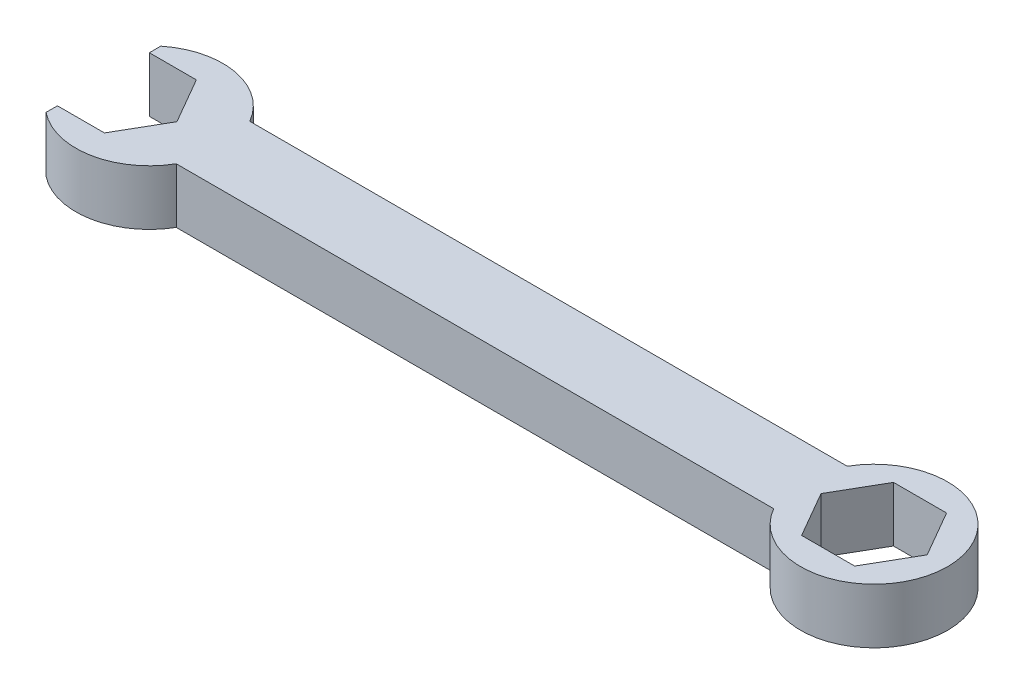
ISO-10303-21;
HEADER;
FILE_DESCRIPTION(('STEP AP214'),'2;1');
FILE_NAME('part.step','',(''),(''),'','','');
FILE_SCHEMA(('AUTOMOTIVE_DESIGN { 1 0 10303 214 1 1 1 1 }'));
ENDSEC;
DATA;
#1=APPLICATION_CONTEXT('core data for automotive mechanical design processes');
#2=APPLICATION_PROTOCOL_DEFINITION('international standard','automotive_design',2000,#1);
#3=PRODUCT_CONTEXT('',#1,'mechanical');
#4=PRODUCT('Part','Part','',(#3));
#5=PRODUCT_RELATED_PRODUCT_CATEGORY('part','',(#4));
#6=PRODUCT_DEFINITION_FORMATION('','',#4);
#7=PRODUCT_DEFINITION_CONTEXT('part definition',#1,'design');
#8=PRODUCT_DEFINITION('design','',#6,#7);
#9=PRODUCT_DEFINITION_SHAPE('','',#8);
#10=(LENGTH_UNIT() NAMED_UNIT(*) SI_UNIT(.MILLI.,.METRE.));
#11=(NAMED_UNIT(*) PLANE_ANGLE_UNIT() SI_UNIT($,.RADIAN.));
#12=(NAMED_UNIT(*) SI_UNIT($,.STERADIAN.) SOLID_ANGLE_UNIT());
#13=UNCERTAINTY_MEASURE_WITH_UNIT(LENGTH_MEASURE(1.E-05),#10,'distance_accuracy_value','');
#14=(GEOMETRIC_REPRESENTATION_CONTEXT(3) GLOBAL_UNCERTAINTY_ASSIGNED_CONTEXT((#13)) GLOBAL_UNIT_ASSIGNED_CONTEXT((#10,
#11,#12)) REPRESENTATION_CONTEXT('',''));
#15=CARTESIAN_POINT('',(0.,0.,0.));
#16=DIRECTION('',(0.,0.,1.));
#17=DIRECTION('',(1.,0.,0.));
#18=AXIS2_PLACEMENT_3D('',#15,#16,#17);
#19=CARTESIAN_POINT('',(0.,7.62,0.));
#20=DIRECTION('',(0.,-1.,0.));
#21=DIRECTION('',(0.,0.,-1.));
#22=AXIS2_PLACEMENT_3D('',#19,#20,#21);
#23=CYLINDRICAL_SURFACE('',#22,10.16);
#24=CARTESIAN_POINT('',(0.,0.,0.));
#25=DIRECTION('',(0.,1.,0.));
#26=DIRECTION('',(0.,0.,1.));
#27=AXIS2_PLACEMENT_3D('',#24,#25,#26);
#28=CIRCLE('',#27,10.16);
#29=CARTESIAN_POINT('',(-8.79881810244989,0.,5.08000000000002));
#30=VERTEX_POINT('',#29);
#31=CARTESIAN_POINT('',(-8.79881810244991,0.,-5.07999999999998));
#32=VERTEX_POINT('',#31);
#33=EDGE_CURVE('E280',#30,#32,#28,.T.);
#34=ORIENTED_EDGE('',*,*,#33,.T.);
#35=DIRECTION('',(0.,-1.,0.));
#36=VECTOR('',#35,1.);
#37=CARTESIAN_POINT('',(-8.79881810244991,7.62,-5.07999999999998));
#38=LINE('',#37,#36);
#39=CARTESIAN_POINT('',(-8.79881810244991,7.62,-5.07999999999998));
#40=VERTEX_POINT('',#39);
#41=EDGE_CURVE('E11',#40,#32,#38,.T.);
#42=ORIENTED_EDGE('',*,*,#41,.F.);
#43=CARTESIAN_POINT('',(0.,7.62,0.));
#44=DIRECTION('',(0.,1.,0.));
#45=DIRECTION('',(0.,0.,1.));
#46=AXIS2_PLACEMENT_3D('',#43,#44,#45);
#47=CIRCLE('',#46,10.16);
#48=CARTESIAN_POINT('',(-8.79881810244989,7.62,5.08000000000002));
#49=VERTEX_POINT('',#48);
#50=EDGE_CURVE('E200',#49,#40,#47,.T.);
#51=ORIENTED_EDGE('',*,*,#50,.F.);
#52=DIRECTION('',(0.,-1.,0.));
#53=VECTOR('',#52,1.);
#54=CARTESIAN_POINT('',(-8.79881810244989,7.62,5.08000000000002));
#55=LINE('',#54,#53);
#56=EDGE_CURVE('E228',#49,#30,#55,.T.);
#57=ORIENTED_EDGE('',*,*,#56,.T.);
#58=EDGE_LOOP('',(#34,#42,#51,#57));
#59=FACE_BOUND('',#58,.T.);
#60=ADVANCED_FACE('F41',(#59),#23,.T.);
#61=CARTESIAN_POINT('',(0.,7.62,-5.07999999999998));
#62=DIRECTION('',(0.,0.,-1.));
#63=DIRECTION('',(-1.,0.,0.));
#64=AXIS2_PLACEMENT_3D('',#61,#62,#63);
#65=PLANE('',#64);
#66=DIRECTION('',(1.,0.,0.));
#67=VECTOR('',#66,1.);
#68=CARTESIAN_POINT('',(0.,0.,-5.07999999999998));
#69=LINE('',#68,#67);
#70=CARTESIAN_POINT('',(-91.3488181024499,0.,-5.07999999999999));
#71=VERTEX_POINT('',#70);
#72=EDGE_CURVE('E283',#71,#32,#69,.T.);
#73=ORIENTED_EDGE('',*,*,#72,.F.);
#74=DIRECTION('',(0.,-1.,0.));
#75=VECTOR('',#74,1.);
#76=CARTESIAN_POINT('',(-91.3488181024499,7.62,-5.07999999999999));
#77=LINE('',#76,#75);
#78=CARTESIAN_POINT('',(-91.3488181024499,7.62,-5.07999999999999));
#79=VERTEX_POINT('',#78);
#80=EDGE_CURVE('E51',#79,#71,#77,.T.);
#81=ORIENTED_EDGE('',*,*,#80,.F.);
#82=DIRECTION('',(1.,0.,0.));
#83=VECTOR('',#82,1.);
#84=CARTESIAN_POINT('',(0.,7.62,-5.07999999999998));
#85=LINE('',#84,#83);
#86=EDGE_CURVE('E194',#79,#40,#85,.T.);
#87=ORIENTED_EDGE('',*,*,#86,.T.);
#88=ORIENTED_EDGE('',*,*,#41,.T.);
#89=EDGE_LOOP('',(#73,#81,#87,#88));
#90=FACE_BOUND('',#89,.T.);
#91=ADVANCED_FACE('F325',(#90),#65,.T.);
#92=CARTESIAN_POINT('',(-100.1476362049,7.62,0.));
#93=DIRECTION('',(0.,-1.,0.));
#94=DIRECTION('',(0.,0.,-1.));
#95=AXIS2_PLACEMENT_3D('',#92,#93,#94);
#96=CYLINDRICAL_SURFACE('',#95,10.16);
#97=CARTESIAN_POINT('',(-100.1476362049,0.,0.));
#98=DIRECTION('',(0.,1.,0.));
#99=DIRECTION('',(0.,0.,1.));
#100=AXIS2_PLACEMENT_3D('',#97,#98,#99);
#101=CIRCLE('',#100,10.16);
#102=CARTESIAN_POINT('',(-106.4976362049,0.,-7.93114745796597));
#103=VERTEX_POINT('',#102);
#104=EDGE_CURVE('E223',#71,#103,#101,.T.);
#105=ORIENTED_EDGE('',*,*,#104,.T.);
#106=DIRECTION('',(0.,-1.,0.));
#107=VECTOR('',#106,1.);
#108=CARTESIAN_POINT('',(-106.4976362049,7.62,-7.93114745796597));
#109=LINE('',#108,#107);
#110=CARTESIAN_POINT('',(-106.4976362049,7.62,-7.93114745796597));
#111=VERTEX_POINT('',#110);
#112=EDGE_CURVE('E240',#111,#103,#109,.T.);
#113=ORIENTED_EDGE('',*,*,#112,.F.);
#114=CARTESIAN_POINT('',(-100.1476362049,7.62,0.));
#115=DIRECTION('',(0.,1.,0.));
#116=DIRECTION('',(0.,0.,1.));
#117=AXIS2_PLACEMENT_3D('',#114,#115,#116);
#118=CIRCLE('',#117,10.16);
#119=EDGE_CURVE('E190',#79,#111,#118,.T.);
#120=ORIENTED_EDGE('',*,*,#119,.F.);
#121=ORIENTED_EDGE('',*,*,#80,.T.);
#122=EDGE_LOOP('',(#105,#113,#120,#121));
#123=FACE_BOUND('',#122,.T.);
#124=ADVANCED_FACE('F323',(#123),#96,.T.);
#125=CARTESIAN_POINT('',(-106.4976362049,7.62,0.));
#126=DIRECTION('',(1.,0.,0.));
#127=DIRECTION('',(0.,0.,-1.));
#128=AXIS2_PLACEMENT_3D('',#125,#126,#127);
#129=PLANE('',#128);
#130=DIRECTION('',(0.,0.,1.));
#131=VECTOR('',#130,1.);
#132=CARTESIAN_POINT('',(-106.4976362049,0.,0.));
#133=LINE('',#132,#131);
#134=CARTESIAN_POINT('',(-106.4976362049,0.,-6.34999999999995));
#135=VERTEX_POINT('',#134);
#136=EDGE_CURVE('E286',#103,#135,#133,.T.);
#137=ORIENTED_EDGE('',*,*,#136,.T.);
#138=DIRECTION('',(0.,-1.,0.));
#139=VECTOR('',#138,1.);
#140=CARTESIAN_POINT('',(-106.4976362049,7.62,-6.34999999999995));
#141=LINE('',#140,#139);
#142=CARTESIAN_POINT('',(-106.4976362049,7.62,-6.34999999999995));
#143=VERTEX_POINT('',#142);
#144=EDGE_CURVE('E238',#143,#135,#141,.T.);
#145=ORIENTED_EDGE('',*,*,#144,.F.);
#146=DIRECTION('',(0.,0.,1.));
#147=VECTOR('',#146,1.);
#148=CARTESIAN_POINT('',(-106.4976362049,7.62,0.));
#149=LINE('',#148,#147);
#150=EDGE_CURVE('E180',#111,#143,#149,.T.);
#151=ORIENTED_EDGE('',*,*,#150,.F.);
#152=ORIENTED_EDGE('',*,*,#112,.T.);
#153=EDGE_LOOP('',(#137,#145,#151,#152));
#154=FACE_BOUND('',#153,.T.);
#155=ADVANCED_FACE('F321',(#154),#129,.F.);
#156=CARTESIAN_POINT('',(0.,7.62,-6.34999999999995));
#157=DIRECTION('',(0.,0.,1.));
#158=DIRECTION('',(1.,0.,0.));
#159=AXIS2_PLACEMENT_3D('',#156,#157,#158);
#160=PLANE('',#159);
#161=DIRECTION('',(-1.,0.,0.));
#162=VECTOR('',#161,1.);
#163=CARTESIAN_POINT('',(0.,0.,-6.34999999999995));
#164=LINE('',#163,#162);
#165=CARTESIAN_POINT('',(-100.003810414254,0.,-6.34999999999995));
#166=VERTEX_POINT('',#165);
#167=EDGE_CURVE('E289',#166,#135,#164,.T.);
#168=ORIENTED_EDGE('',*,*,#167,.F.);
#169=DIRECTION('',(0.,-1.,0.));
#170=VECTOR('',#169,1.);
#171=CARTESIAN_POINT('',(-100.003810414254,7.62,-6.34999999999995));
#172=LINE('',#171,#170);
#173=CARTESIAN_POINT('',(-100.003810414254,7.62,-6.34999999999995));
#174=VERTEX_POINT('',#173);
#175=EDGE_CURVE('E236',#174,#166,#172,.T.);
#176=ORIENTED_EDGE('',*,*,#175,.F.);
#177=DIRECTION('',(-1.,0.,0.));
#178=VECTOR('',#177,1.);
#179=CARTESIAN_POINT('',(0.,7.62,-6.34999999999995));
#180=LINE('',#179,#178);
#181=EDGE_CURVE('E198',#174,#143,#180,.T.);
#182=ORIENTED_EDGE('',*,*,#181,.T.);
#183=ORIENTED_EDGE('',*,*,#144,.T.);
#184=EDGE_LOOP('',(#168,#176,#182,#183));
#185=FACE_BOUND('',#184,.T.);
#186=ADVANCED_FACE('F315',(#185),#160,.T.);
#187=CARTESIAN_POINT('',(-72.2532271536748,7.62,41.7154201469934));
#188=DIRECTION('',(-0.866025403784438,0.,0.500000000000001));
#189=DIRECTION('',(0.500000000000001,0.,0.866025403784438));
#190=AXIS2_PLACEMENT_3D('',#187,#188,#189);
#191=PLANE('',#190);
#192=DIRECTION('',(-0.500000000000001,0.,-0.866025403784438));
#193=VECTOR('',#192,1.);
#194=CARTESIAN_POINT('',(-72.2532271536748,0.,41.7154201469934));
#195=LINE('',#194,#193);
#196=CARTESIAN_POINT('',(-96.3376362048998,0.,0.));
#197=VERTEX_POINT('',#196);
#198=EDGE_CURVE('E292',#197,#166,#195,.T.);
#199=ORIENTED_EDGE('',*,*,#198,.F.);
#200=DIRECTION('',(0.,-1.,0.));
#201=VECTOR('',#200,1.);
#202=CARTESIAN_POINT('',(-96.3376362048998,7.62,0.));
#203=LINE('',#202,#201);
#204=CARTESIAN_POINT('',(-96.3376362048998,7.62,0.));
#205=VERTEX_POINT('',#204);
#206=EDGE_CURVE('E234',#205,#197,#203,.T.);
#207=ORIENTED_EDGE('',*,*,#206,.F.);
#208=DIRECTION('',(-0.500000000000001,0.,-0.866025403784438));
#209=VECTOR('',#208,1.);
#210=CARTESIAN_POINT('',(-72.2532271536748,7.62,41.7154201469934));
#211=LINE('',#210,#209);
#212=EDGE_CURVE('E541',#205,#174,#211,.T.);
#213=ORIENTED_EDGE('',*,*,#212,.T.);
#214=ORIENTED_EDGE('',*,*,#175,.T.);
#215=EDGE_LOOP('',(#199,#207,#213,#214));
#216=FACE_BOUND('',#215,.T.);
#217=ADVANCED_FACE('F310',(#216),#191,.T.);
#218=CARTESIAN_POINT('',(-72.2532271536749,7.62,-41.7154201469933));
#219=DIRECTION('',(-0.866025403784439,0.,-0.5));
#220=DIRECTION('',(-0.5,0.,0.866025403784439));
#221=AXIS2_PLACEMENT_3D('',#218,#219,#220);
#222=PLANE('',#221);
#223=DIRECTION('',(0.5,0.,-0.866025403784439));
#224=VECTOR('',#223,1.);
#225=CARTESIAN_POINT('',(-72.2532271536749,0.,-41.7154201469933));
#226=LINE('',#225,#224);
#227=CARTESIAN_POINT('',(-100.003810414254,0.,6.35000000000002));
#228=VERTEX_POINT('',#227);
#229=EDGE_CURVE('E294',#228,#197,#226,.T.);
#230=ORIENTED_EDGE('',*,*,#229,.F.);
#231=DIRECTION('',(0.,-1.,0.));
#232=VECTOR('',#231,1.);
#233=CARTESIAN_POINT('',(-100.003810414254,7.62,6.35000000000002));
#234=LINE('',#233,#232);
#235=CARTESIAN_POINT('',(-100.003810414254,7.62,6.35000000000002));
#236=VERTEX_POINT('',#235);
#237=EDGE_CURVE('E232',#236,#228,#234,.T.);
#238=ORIENTED_EDGE('',*,*,#237,.F.);
#239=DIRECTION('',(0.5,0.,-0.866025403784439));
#240=VECTOR('',#239,1.);
#241=CARTESIAN_POINT('',(-72.2532271536749,7.62,-41.7154201469933));
#242=LINE('',#241,#240);
#243=EDGE_CURVE('E306',#236,#205,#242,.T.);
#244=ORIENTED_EDGE('',*,*,#243,.T.);
#245=ORIENTED_EDGE('',*,*,#206,.T.);
#246=EDGE_LOOP('',(#230,#238,#244,#245));
#247=FACE_BOUND('',#246,.T.);
#248=ADVANCED_FACE('F304',(#247),#222,.T.);
#249=CARTESIAN_POINT('',(0.,7.62,6.35000000000001));
#250=DIRECTION('',(0.,0.,-1.));
#251=DIRECTION('',(-1.,0.,0.));
#252=AXIS2_PLACEMENT_3D('',#249,#250,#251);
#253=PLANE('',#252);
#254=DIRECTION('',(1.,0.,0.));
#255=VECTOR('',#254,1.);
#256=CARTESIAN_POINT('',(0.,0.,6.35000000000001));
#257=LINE('',#256,#255);
#258=CARTESIAN_POINT('',(-106.4976362049,0.,6.35000000000002));
#259=VERTEX_POINT('',#258);
#260=EDGE_CURVE('E226',#259,#228,#257,.T.);
#261=ORIENTED_EDGE('',*,*,#260,.F.);
#262=DIRECTION('',(0.,-1.,0.));
#263=VECTOR('',#262,1.);
#264=CARTESIAN_POINT('',(-106.4976362049,7.62,6.35000000000002));
#265=LINE('',#264,#263);
#266=CARTESIAN_POINT('',(-106.4976362049,7.62,6.35000000000002));
#267=VERTEX_POINT('',#266);
#268=EDGE_CURVE('E185',#267,#259,#265,.T.);
#269=ORIENTED_EDGE('',*,*,#268,.F.);
#270=DIRECTION('',(1.,0.,0.));
#271=VECTOR('',#270,1.);
#272=CARTESIAN_POINT('',(0.,7.62,6.35000000000001));
#273=LINE('',#272,#271);
#274=EDGE_CURVE('E177',#267,#236,#273,.T.);
#275=ORIENTED_EDGE('',*,*,#274,.T.);
#276=ORIENTED_EDGE('',*,*,#237,.T.);
#277=EDGE_LOOP('',(#261,#269,#275,#276));
#278=FACE_BOUND('',#277,.T.);
#279=ADVANCED_FACE('F301',(#278),#253,.T.);
#280=CARTESIAN_POINT('',(-106.4976362049,0.,7.93114745796601));
#281=VERTEX_POINT('',#280);
#282=EDGE_CURVE('E184',#259,#281,#133,.T.);
#283=ORIENTED_EDGE('',*,*,#282,.T.);
#284=DIRECTION('',(0.,-1.,0.));
#285=VECTOR('',#284,1.);
#286=CARTESIAN_POINT('',(-106.4976362049,7.62,7.93114745796601));
#287=LINE('',#286,#285);
#288=CARTESIAN_POINT('',(-106.4976362049,7.62,7.93114745796601));
#289=VERTEX_POINT('',#288);
#290=EDGE_CURVE('E181',#289,#281,#287,.T.);
#291=ORIENTED_EDGE('',*,*,#290,.F.);
#292=EDGE_CURVE('E170',#267,#289,#149,.T.);
#293=ORIENTED_EDGE('',*,*,#292,.F.);
#294=ORIENTED_EDGE('',*,*,#268,.T.);
#295=EDGE_LOOP('',(#283,#291,#293,#294));
#296=FACE_BOUND('',#295,.T.);
#297=ADVANCED_FACE('F182',(#296),#129,.F.);
#298=CARTESIAN_POINT('',(-91.3488181024499,0.,5.08000000000002));
#299=VERTEX_POINT('',#298);
#300=EDGE_CURVE('E115',#281,#299,#101,.T.);
#301=ORIENTED_EDGE('',*,*,#300,.T.);
#302=DIRECTION('',(0.,-1.,0.));
#303=VECTOR('',#302,1.);
#304=CARTESIAN_POINT('',(-91.3488181024499,7.62,5.08000000000002));
#305=LINE('',#304,#303);
#306=CARTESIAN_POINT('',(-91.3488181024499,7.62,5.08000000000002));
#307=VERTEX_POINT('',#306);
#308=EDGE_CURVE('E186',#307,#299,#305,.T.);
#309=ORIENTED_EDGE('',*,*,#308,.F.);
#310=EDGE_CURVE('E174',#289,#307,#118,.T.);
#311=ORIENTED_EDGE('',*,*,#310,.F.);
#312=ORIENTED_EDGE('',*,*,#290,.T.);
#313=EDGE_LOOP('',(#301,#309,#311,#312));
#314=FACE_BOUND('',#313,.T.);
#315=ADVANCED_FACE('F188',(#314),#96,.T.);
#316=CARTESIAN_POINT('',(5.49926131403119,7.62,3.175));
#317=DIRECTION('',(-0.866025403784439,0.,-0.5));
#318=DIRECTION('',(-0.5,0.,0.866025403784439));
#319=AXIS2_PLACEMENT_3D('',#316,#317,#318);
#320=PLANE('',#319);
#321=DIRECTION('',(0.5,0.,-0.866025403784439));
#322=VECTOR('',#321,1.);
#323=CARTESIAN_POINT('',(5.49926131403119,0.,3.175));
#324=LINE('',#323,#322);
#325=CARTESIAN_POINT('',(3.66617420935413,0.,6.35));
#326=VERTEX_POINT('',#325);
#327=CARTESIAN_POINT('',(7.33234841870825,0.,0.));
#328=VERTEX_POINT('',#327);
#329=EDGE_CURVE('E261',#326,#328,#324,.T.);
#330=ORIENTED_EDGE('',*,*,#329,.F.);
#331=DIRECTION('',(0.,-1.,0.));
#332=VECTOR('',#331,1.);
#333=CARTESIAN_POINT('',(3.66617420935413,7.62,6.35));
#334=LINE('',#333,#332);
#335=CARTESIAN_POINT('',(3.66617420935413,7.62,6.35));
#336=VERTEX_POINT('',#335);
#337=EDGE_CURVE('E45',#336,#326,#334,.T.);
#338=ORIENTED_EDGE('',*,*,#337,.F.);
#339=DIRECTION('',(0.5,0.,-0.866025403784439));
#340=VECTOR('',#339,1.);
#341=CARTESIAN_POINT('',(5.49926131403119,7.62,3.175));
#342=LINE('',#341,#340);
#343=CARTESIAN_POINT('',(7.33234841870825,7.62,0.));
#344=VERTEX_POINT('',#343);
#345=EDGE_CURVE('E219',#336,#344,#342,.T.);
#346=ORIENTED_EDGE('',*,*,#345,.T.);
#347=DIRECTION('',(0.,-1.,0.));
#348=VECTOR('',#347,1.);
#349=CARTESIAN_POINT('',(7.33234841870825,7.62,0.));
#350=LINE('',#349,#348);
#351=EDGE_CURVE('E191',#344,#328,#350,.T.);
#352=ORIENTED_EDGE('',*,*,#351,.T.);
#353=EDGE_LOOP('',(#330,#338,#346,#352));
#354=FACE_BOUND('',#353,.T.);
#355=ADVANCED_FACE('F43',(#354),#320,.T.);
#356=CARTESIAN_POINT('',(0.,7.62,6.35));
#357=DIRECTION('',(0.,0.,-1.));
#358=DIRECTION('',(-1.,0.,0.));
#359=AXIS2_PLACEMENT_3D('',#356,#357,#358);
#360=PLANE('',#359);
#361=DIRECTION('',(1.,0.,0.));
#362=VECTOR('',#361,1.);
#363=CARTESIAN_POINT('',(0.,0.,6.35));
#364=LINE('',#363,#362);
#365=CARTESIAN_POINT('',(-3.66617420935412,0.,6.35));
#366=VERTEX_POINT('',#365);
#367=EDGE_CURVE('E257',#366,#326,#364,.T.);
#368=ORIENTED_EDGE('',*,*,#367,.F.);
#369=DIRECTION('',(0.,-1.,0.));
#370=VECTOR('',#369,1.);
#371=CARTESIAN_POINT('',(-3.66617420935412,7.62,6.35));
#372=LINE('',#371,#370);
#373=CARTESIAN_POINT('',(-3.66617420935412,7.62,6.35));
#374=VERTEX_POINT('',#373);
#375=EDGE_CURVE('E250',#374,#366,#372,.T.);
#376=ORIENTED_EDGE('',*,*,#375,.F.);
#377=DIRECTION('',(1.,0.,0.));
#378=VECTOR('',#377,1.);
#379=CARTESIAN_POINT('',(0.,7.62,6.35));
#380=LINE('',#379,#378);
#381=EDGE_CURVE('E216',#374,#336,#380,.T.);
#382=ORIENTED_EDGE('',*,*,#381,.T.);
#383=ORIENTED_EDGE('',*,*,#337,.T.);
#384=EDGE_LOOP('',(#368,#376,#382,#383));
#385=FACE_BOUND('',#384,.T.);
#386=ADVANCED_FACE('F255',(#385),#360,.T.);
#387=CARTESIAN_POINT('',(-5.49926131403118,7.62,3.175));
#388=DIRECTION('',(0.866025403784439,0.,-0.5));
#389=DIRECTION('',(-0.5,0.,-0.866025403784439));
#390=AXIS2_PLACEMENT_3D('',#387,#388,#389);
#391=PLANE('',#390);
#392=DIRECTION('',(0.5,0.,0.866025403784439));
#393=VECTOR('',#392,1.);
#394=CARTESIAN_POINT('',(-5.49926131403118,0.,3.175));
#395=LINE('',#394,#393);
#396=CARTESIAN_POINT('',(-7.33234841870825,0.,0.));
#397=VERTEX_POINT('',#396);
#398=EDGE_CURVE('E269',#397,#366,#395,.T.);
#399=ORIENTED_EDGE('',*,*,#398,.F.);
#400=DIRECTION('',(0.,-1.,0.));
#401=VECTOR('',#400,1.);
#402=CARTESIAN_POINT('',(-7.33234841870825,7.62,0.));
#403=LINE('',#402,#401);
#404=CARTESIAN_POINT('',(-7.33234841870825,7.62,0.));
#405=VERTEX_POINT('',#404);
#406=EDGE_CURVE('E249',#405,#397,#403,.T.);
#407=ORIENTED_EDGE('',*,*,#406,.F.);
#408=DIRECTION('',(0.5,0.,0.866025403784439));
#409=VECTOR('',#408,1.);
#410=CARTESIAN_POINT('',(-5.49926131403118,7.62,3.175));
#411=LINE('',#410,#409);
#412=EDGE_CURVE('E213',#405,#374,#411,.T.);
#413=ORIENTED_EDGE('',*,*,#412,.T.);
#414=ORIENTED_EDGE('',*,*,#375,.T.);
#415=EDGE_LOOP('',(#399,#407,#413,#414));
#416=FACE_BOUND('',#415,.T.);
#417=ADVANCED_FACE('F358',(#416),#391,.T.);
#418=CARTESIAN_POINT('',(-5.49926131403119,7.62,-3.175));
#419=DIRECTION('',(0.866025403784439,0.,0.5));
#420=DIRECTION('',(0.5,0.,-0.866025403784439));
#421=AXIS2_PLACEMENT_3D('',#418,#419,#420);
#422=PLANE('',#421);
#423=DIRECTION('',(-0.5,0.,0.866025403784439));
#424=VECTOR('',#423,1.);
#425=CARTESIAN_POINT('',(-5.49926131403119,0.,-3.175));
#426=LINE('',#425,#424);
#427=CARTESIAN_POINT('',(-3.66617420935412,0.,-6.35));
#428=VERTEX_POINT('',#427);
#429=EDGE_CURVE('E271',#428,#397,#426,.T.);
#430=ORIENTED_EDGE('',*,*,#429,.F.);
#431=DIRECTION('',(0.,-1.,0.));
#432=VECTOR('',#431,1.);
#433=CARTESIAN_POINT('',(-3.66617420935412,7.62,-6.35));
#434=LINE('',#433,#432);
#435=CARTESIAN_POINT('',(-3.66617420935412,7.62,-6.35));
#436=VERTEX_POINT('',#435);
#437=EDGE_CURVE('E247',#436,#428,#434,.T.);
#438=ORIENTED_EDGE('',*,*,#437,.F.);
#439=DIRECTION('',(-0.5,0.,0.866025403784439));
#440=VECTOR('',#439,1.);
#441=CARTESIAN_POINT('',(-5.49926131403119,7.62,-3.175));
#442=LINE('',#441,#440);
#443=EDGE_CURVE('E210',#436,#405,#442,.T.);
#444=ORIENTED_EDGE('',*,*,#443,.T.);
#445=ORIENTED_EDGE('',*,*,#406,.T.);
#446=EDGE_LOOP('',(#430,#438,#444,#445));
#447=FACE_BOUND('',#446,.T.);
#448=ADVANCED_FACE('F354',(#447),#422,.T.);
#449=CARTESIAN_POINT('',(0.,7.62,-6.35));
#450=DIRECTION('',(0.,0.,1.));
#451=DIRECTION('',(1.,0.,0.));
#452=AXIS2_PLACEMENT_3D('',#449,#450,#451);
#453=PLANE('',#452);
#454=DIRECTION('',(-1.,0.,0.));
#455=VECTOR('',#454,1.);
#456=CARTESIAN_POINT('',(0.,0.,-6.35));
#457=LINE('',#456,#455);
#458=CARTESIAN_POINT('',(3.66617420935412,0.,-6.35));
#459=VERTEX_POINT('',#458);
#460=EDGE_CURVE('E275',#459,#428,#457,.T.);
#461=ORIENTED_EDGE('',*,*,#460,.F.);
#462=DIRECTION('',(0.,-1.,0.));
#463=VECTOR('',#462,1.);
#464=CARTESIAN_POINT('',(3.66617420935412,7.62,-6.35));
#465=LINE('',#464,#463);
#466=CARTESIAN_POINT('',(3.66617420935412,7.62,-6.35));
#467=VERTEX_POINT('',#466);
#468=EDGE_CURVE('E245',#467,#459,#465,.T.);
#469=ORIENTED_EDGE('',*,*,#468,.F.);
#470=DIRECTION('',(-1.,0.,0.));
#471=VECTOR('',#470,1.);
#472=CARTESIAN_POINT('',(0.,7.62,-6.35));
#473=LINE('',#472,#471);
#474=EDGE_CURVE('E207',#467,#436,#473,.T.);
#475=ORIENTED_EDGE('',*,*,#474,.T.);
#476=ORIENTED_EDGE('',*,*,#437,.T.);
#477=EDGE_LOOP('',(#461,#469,#475,#476));
#478=FACE_BOUND('',#477,.T.);
#479=ADVANCED_FACE('F339',(#478),#453,.T.);
#480=CARTESIAN_POINT('',(5.49926131403118,7.62,-3.175));
#481=DIRECTION('',(-0.866025403784438,0.,0.5));
#482=DIRECTION('',(0.5,0.,0.866025403784438));
#483=AXIS2_PLACEMENT_3D('',#480,#481,#482);
#484=PLANE('',#483);
#485=DIRECTION('',(-0.5,0.,-0.866025403784438));
#486=VECTOR('',#485,1.);
#487=CARTESIAN_POINT('',(5.49926131403118,0.,-3.175));
#488=LINE('',#487,#486);
#489=EDGE_CURVE('E278',#328,#459,#488,.T.);
#490=ORIENTED_EDGE('',*,*,#489,.F.);
#491=ORIENTED_EDGE('',*,*,#351,.F.);
#492=DIRECTION('',(-0.5,0.,-0.866025403784438));
#493=VECTOR('',#492,1.);
#494=CARTESIAN_POINT('',(5.49926131403118,7.62,-3.175));
#495=LINE('',#494,#493);
#496=EDGE_CURVE('E202',#344,#467,#495,.T.);
#497=ORIENTED_EDGE('',*,*,#496,.T.);
#498=ORIENTED_EDGE('',*,*,#468,.T.);
#499=EDGE_LOOP('',(#490,#491,#497,#498));
#500=FACE_BOUND('',#499,.T.);
#501=ADVANCED_FACE('F331',(#500),#484,.T.);
#502=CARTESIAN_POINT('',(0.,7.62,5.08000000000002));
#503=DIRECTION('',(0.,0.,-1.));
#504=DIRECTION('',(-1.,0.,0.));
#505=AXIS2_PLACEMENT_3D('',#502,#503,#504);
#506=PLANE('',#505);
#507=DIRECTION('',(1.,0.,0.));
#508=VECTOR('',#507,1.);
#509=CARTESIAN_POINT('',(0.,0.,5.08000000000002));
#510=LINE('',#509,#508);
#511=EDGE_CURVE('E121',#299,#30,#510,.T.);
#512=ORIENTED_EDGE('',*,*,#511,.T.);
#513=ORIENTED_EDGE('',*,*,#56,.F.);
#514=DIRECTION('',(1.,0.,0.));
#515=VECTOR('',#514,1.);
#516=CARTESIAN_POINT('',(0.,7.62,5.08000000000002));
#517=LINE('',#516,#515);
#518=EDGE_CURVE('E60',#307,#49,#517,.T.);
#519=ORIENTED_EDGE('',*,*,#518,.F.);
#520=ORIENTED_EDGE('',*,*,#308,.T.);
#521=EDGE_LOOP('',(#512,#513,#519,#520));
#522=FACE_BOUND('',#521,.T.);
#523=ADVANCED_FACE('F329',(#522),#506,.F.);
#524=CARTESIAN_POINT('',(0.,7.62,0.));
#525=DIRECTION('',(0.,1.,0.));
#526=DIRECTION('',(0.,0.,1.));
#527=AXIS2_PLACEMENT_3D('',#524,#525,#526);
#528=PLANE('',#527);
#529=ORIENTED_EDGE('',*,*,#345,.F.);
#530=ORIENTED_EDGE('',*,*,#381,.F.);
#531=ORIENTED_EDGE('',*,*,#412,.F.);
#532=ORIENTED_EDGE('',*,*,#443,.F.);
#533=ORIENTED_EDGE('',*,*,#474,.F.);
#534=ORIENTED_EDGE('',*,*,#496,.F.);
#535=EDGE_LOOP('',(#529,#530,#531,#532,#533,#534));
#536=FACE_BOUND('',#535,.T.);
#537=ORIENTED_EDGE('',*,*,#50,.T.);
#538=ORIENTED_EDGE('',*,*,#86,.F.);
#539=ORIENTED_EDGE('',*,*,#119,.T.);
#540=ORIENTED_EDGE('',*,*,#150,.T.);
#541=ORIENTED_EDGE('',*,*,#181,.F.);
#542=ORIENTED_EDGE('',*,*,#212,.F.);
#543=ORIENTED_EDGE('',*,*,#243,.F.);
#544=ORIENTED_EDGE('',*,*,#274,.F.);
#545=ORIENTED_EDGE('',*,*,#292,.T.);
#546=ORIENTED_EDGE('',*,*,#310,.T.);
#547=ORIENTED_EDGE('',*,*,#518,.T.);
#548=EDGE_LOOP('',(#537,#538,#539,#540,#541,#542,#543,#544,#545,#546,#547));
#549=FACE_BOUND('',#548,.T.);
#550=ADVANCED_FACE('F172',(#536,#549),#528,.T.);
#551=CARTESIAN_POINT('',(0.,0.,0.));
#552=DIRECTION('',(0.,1.,0.));
#553=DIRECTION('',(0.,0.,1.));
#554=AXIS2_PLACEMENT_3D('',#551,#552,#553);
#555=PLANE('',#554);
#556=ORIENTED_EDGE('',*,*,#329,.T.);
#557=ORIENTED_EDGE('',*,*,#489,.T.);
#558=ORIENTED_EDGE('',*,*,#460,.T.);
#559=ORIENTED_EDGE('',*,*,#429,.T.);
#560=ORIENTED_EDGE('',*,*,#398,.T.);
#561=ORIENTED_EDGE('',*,*,#367,.T.);
#562=EDGE_LOOP('',(#556,#557,#558,#559,#560,#561));
#563=FACE_BOUND('',#562,.T.);
#564=ORIENTED_EDGE('',*,*,#33,.F.);
#565=ORIENTED_EDGE('',*,*,#511,.F.);
#566=ORIENTED_EDGE('',*,*,#300,.F.);
#567=ORIENTED_EDGE('',*,*,#282,.F.);
#568=ORIENTED_EDGE('',*,*,#260,.T.);
#569=ORIENTED_EDGE('',*,*,#229,.T.);
#570=ORIENTED_EDGE('',*,*,#198,.T.);
#571=ORIENTED_EDGE('',*,*,#167,.T.);
#572=ORIENTED_EDGE('',*,*,#136,.F.);
#573=ORIENTED_EDGE('',*,*,#104,.F.);
#574=ORIENTED_EDGE('',*,*,#72,.T.);
#575=EDGE_LOOP('',(#564,#565,#566,#567,#568,#569,#570,#571,#572,#573,#574));
#576=FACE_BOUND('',#575,.T.);
#577=ADVANCED_FACE('F266',(#563,#576),#555,.F.);
#578=CLOSED_SHELL('',(#60,#91,#124,#155,#186,#217,#248,#279,#297,#315,#355,#386,#417,#448,#479,
#501,#523,#550,#577));
#579=MANIFOLD_SOLID_BREP('B2',#578);
#580=ADVANCED_BREP_SHAPE_REPRESENTATION('',(#18,#579),#14);
#581=SHAPE_DEFINITION_REPRESENTATION(#9,#580);
ENDSEC;
END-ISO-10303-21;
